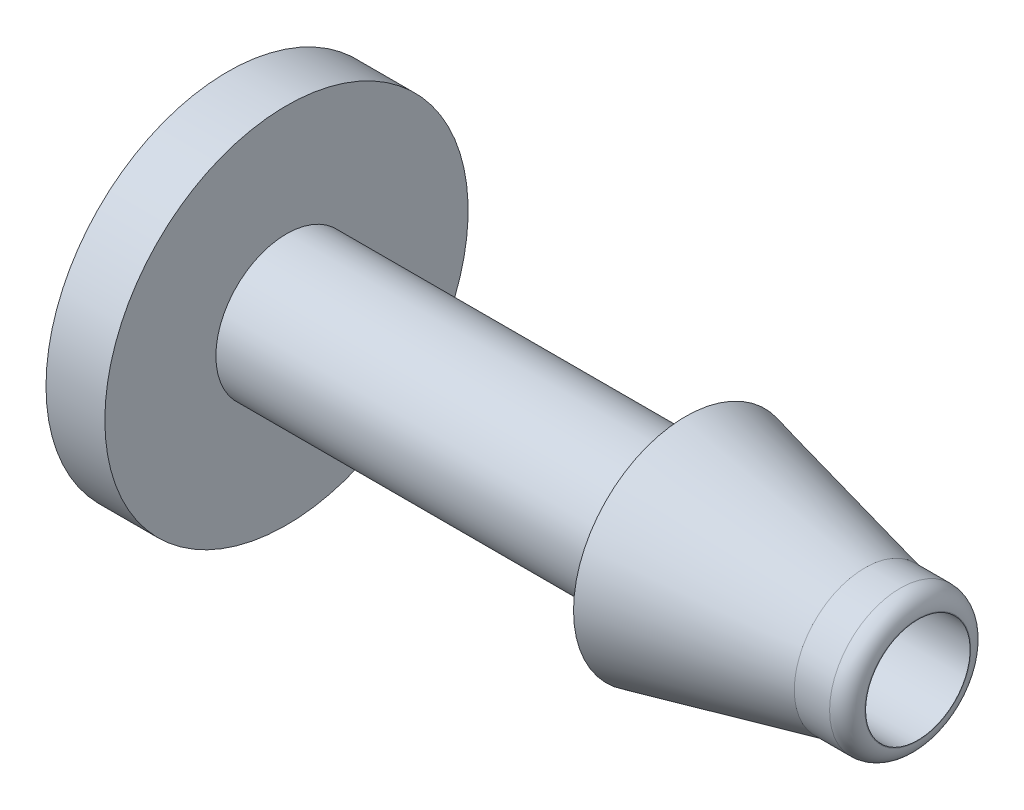
ISO-10303-21;
HEADER;
FILE_DESCRIPTION(('STEP AP214'),'2;1');
FILE_NAME('part.step','',(''),(''),'','','');
FILE_SCHEMA(('AUTOMOTIVE_DESIGN { 1 0 10303 214 1 1 1 1 }'));
ENDSEC;
DATA;
#1=APPLICATION_CONTEXT('core data for automotive mechanical design processes');
#2=APPLICATION_PROTOCOL_DEFINITION('international standard','automotive_design',2000,#1);
#3=PRODUCT_CONTEXT('',#1,'mechanical');
#4=PRODUCT('Part','Part','',(#3));
#5=PRODUCT_RELATED_PRODUCT_CATEGORY('part','',(#4));
#6=PRODUCT_DEFINITION_FORMATION('','',#4);
#7=PRODUCT_DEFINITION_CONTEXT('part definition',#1,'design');
#8=PRODUCT_DEFINITION('design','',#6,#7);
#9=PRODUCT_DEFINITION_SHAPE('','',#8);
#10=(LENGTH_UNIT() NAMED_UNIT(*) SI_UNIT(.MILLI.,.METRE.));
#11=(NAMED_UNIT(*) PLANE_ANGLE_UNIT() SI_UNIT($,.RADIAN.));
#12=(NAMED_UNIT(*) SI_UNIT($,.STERADIAN.) SOLID_ANGLE_UNIT());
#13=UNCERTAINTY_MEASURE_WITH_UNIT(LENGTH_MEASURE(1.E-05),#10,'distance_accuracy_value','');
#14=(GEOMETRIC_REPRESENTATION_CONTEXT(3) GLOBAL_UNCERTAINTY_ASSIGNED_CONTEXT((#13)) GLOBAL_UNIT_ASSIGNED_CONTEXT((#10,
#11,#12)) REPRESENTATION_CONTEXT('',''));
#15=CARTESIAN_POINT('',(0.,0.,0.));
#16=DIRECTION('',(0.,0.,1.));
#17=DIRECTION('',(1.,0.,0.));
#18=AXIS2_PLACEMENT_3D('',#15,#16,#17);
#19=CARTESIAN_POINT('',(0.,0.,0.));
#20=DIRECTION('',(-1.,0.,0.));
#21=DIRECTION('',(0.,0.,1.));
#22=AXIS2_PLACEMENT_3D('',#19,#20,#21);
#23=CYLINDRICAL_SURFACE('',#22,1.778);
#24=CARTESIAN_POINT('',(21.59,0.,0.));
#25=DIRECTION('',(-1.,0.,0.));
#26=DIRECTION('',(0.,0.,1.));
#27=AXIS2_PLACEMENT_3D('',#24,#25,#26);
#28=CIRCLE('',#27,1.778);
#29=CARTESIAN_POINT('',(21.59,0.,1.778));
#30=VERTEX_POINT('',#29);
#31=EDGE_CURVE('E12',#30,#30,#28,.T.);
#32=ORIENTED_EDGE('',*,*,#31,.F.);
#33=EDGE_LOOP('',(#32));
#34=FACE_BOUND('',#33,.T.);
#35=CARTESIAN_POINT('',(-1.873,0.,0.));
#36=DIRECTION('',(-1.,0.,0.));
#37=DIRECTION('',(0.,0.,1.));
#38=AXIS2_PLACEMENT_3D('',#35,#36,#37);
#39=CIRCLE('',#38,1.778);
#40=CARTESIAN_POINT('',(-1.873,0.,1.778));
#41=VERTEX_POINT('',#40);
#42=EDGE_CURVE('E81',#41,#41,#39,.T.);
#43=ORIENTED_EDGE('',*,*,#42,.T.);
#44=EDGE_LOOP('',(#43));
#45=FACE_BOUND('',#44,.T.);
#46=ADVANCED_FACE('F41',(#34,#45),#23,.F.);
#47=CARTESIAN_POINT('',(21.59,1.778,0.));
#48=DIRECTION('',(-1.,0.,0.));
#49=DIRECTION('',(0.,0.,1.));
#50=AXIS2_PLACEMENT_3D('',#47,#48,#49);
#51=PLANE('',#50);
#52=CARTESIAN_POINT('',(21.59,0.,0.));
#53=DIRECTION('',(-1.,0.,0.));
#54=DIRECTION('',(0.,0.,1.));
#55=AXIS2_PLACEMENT_3D('',#52,#53,#54);
#56=CIRCLE('',#55,1.80057777777778);
#57=CARTESIAN_POINT('',(21.59,0.,1.80057777777778));
#58=VERTEX_POINT('',#57);
#59=EDGE_CURVE('E48',#58,#58,#56,.T.);
#60=ORIENTED_EDGE('',*,*,#59,.F.);
#61=EDGE_LOOP('',(#60));
#62=FACE_BOUND('',#61,.T.);
#63=ORIENTED_EDGE('',*,*,#31,.T.);
#64=EDGE_LOOP('',(#63));
#65=FACE_BOUND('',#64,.T.);
#66=ADVANCED_FACE('F107',(#62,#65),#51,.F.);
#67=CARTESIAN_POINT('',(20.9902777777778,0.,0.));
#68=DIRECTION('',(-1.,0.,0.));
#69=DIRECTION('',(0.,0.,1.));
#70=AXIS2_PLACEMENT_3D('',#67,#68,#69);
#71=TOROIDAL_SURFACE('',#70,1.80057777777778,0.599722222222223);
#72=CARTESIAN_POINT('',(20.9902777777778,0.,0.));
#73=DIRECTION('',(-1.,0.,0.));
#74=DIRECTION('',(0.,0.,1.));
#75=AXIS2_PLACEMENT_3D('',#72,#73,#74);
#76=CIRCLE('',#75,2.4003);
#77=CARTESIAN_POINT('',(20.9902777777778,0.,2.4003));
#78=VERTEX_POINT('',#77);
#79=EDGE_CURVE('E53',#78,#78,#76,.T.);
#80=ORIENTED_EDGE('',*,*,#79,.F.);
#81=EDGE_LOOP('',(#80));
#82=FACE_BOUND('',#81,.T.);
#83=ORIENTED_EDGE('',*,*,#59,.T.);
#84=EDGE_LOOP('',(#83));
#85=FACE_BOUND('',#84,.T.);
#86=ADVANCED_FACE('F112',(#82,#85),#71,.T.);
#87=CARTESIAN_POINT('',(0.,0.,0.));
#88=DIRECTION('',(-1.,0.,0.));
#89=DIRECTION('',(0.,0.,1.));
#90=AXIS2_PLACEMENT_3D('',#87,#88,#89);
#91=CYLINDRICAL_SURFACE('',#90,2.4003);
#92=CARTESIAN_POINT('',(19.7908333333333,0.,0.));
#93=DIRECTION('',(-1.,0.,0.));
#94=DIRECTION('',(0.,0.,1.));
#95=AXIS2_PLACEMENT_3D('',#92,#93,#94);
#96=CIRCLE('',#95,2.4003);
#97=CARTESIAN_POINT('',(19.7908333333333,0.,2.4003));
#98=VERTEX_POINT('',#97);
#99=EDGE_CURVE('E58',#98,#98,#96,.T.);
#100=ORIENTED_EDGE('',*,*,#99,.F.);
#101=EDGE_LOOP('',(#100));
#102=FACE_BOUND('',#101,.T.);
#103=ORIENTED_EDGE('',*,*,#79,.T.);
#104=EDGE_LOOP('',(#103));
#105=FACE_BOUND('',#104,.T.);
#106=ADVANCED_FACE('F117',(#102,#105),#91,.T.);
#107=CARTESIAN_POINT('',(19.7908333333333,0.,0.));
#108=DIRECTION('',(-1.,0.,0.));
#109=DIRECTION('',(0.,0.,1.));
#110=AXIS2_PLACEMENT_3D('',#107,#108,#109);
#111=CONICAL_SURFACE('',#110,2.4003,0.227255260619181);
#112=CARTESIAN_POINT('',(13.6948333333333,0.,0.));
#113=DIRECTION('',(-1.,0.,0.));
#114=DIRECTION('',(0.,0.,1.));
#115=AXIS2_PLACEMENT_3D('',#112,#113,#114);
#116=CIRCLE('',#115,3.81);
#117=CARTESIAN_POINT('',(13.6948333333333,0.,3.81));
#118=VERTEX_POINT('',#117);
#119=EDGE_CURVE('E64',#118,#118,#116,.T.);
#120=ORIENTED_EDGE('',*,*,#119,.F.);
#121=EDGE_LOOP('',(#120));
#122=FACE_BOUND('',#121,.T.);
#123=ORIENTED_EDGE('',*,*,#99,.T.);
#124=EDGE_LOOP('',(#123));
#125=FACE_BOUND('',#124,.T.);
#126=ADVANCED_FACE('F123',(#122,#125),#111,.T.);
#127=CARTESIAN_POINT('',(13.6948333333333,3.81,0.));
#128=DIRECTION('',(1.,0.,0.));
#129=DIRECTION('',(0.,0.,-1.));
#130=AXIS2_PLACEMENT_3D('',#127,#128,#129);
#131=PLANE('',#130);
#132=CARTESIAN_POINT('',(13.6948333333333,0.,0.));
#133=DIRECTION('',(-1.,0.,0.));
#134=DIRECTION('',(0.,0.,1.));
#135=AXIS2_PLACEMENT_3D('',#132,#133,#134);
#136=CIRCLE('',#135,2.4003);
#137=CARTESIAN_POINT('',(13.6948333333333,0.,2.4003));
#138=VERTEX_POINT('',#137);
#139=EDGE_CURVE('E68',#138,#138,#136,.T.);
#140=ORIENTED_EDGE('',*,*,#139,.F.);
#141=EDGE_LOOP('',(#140));
#142=FACE_BOUND('',#141,.T.);
#143=ORIENTED_EDGE('',*,*,#119,.T.);
#144=EDGE_LOOP('',(#143));
#145=FACE_BOUND('',#144,.T.);
#146=ADVANCED_FACE('F103',(#142,#145),#131,.F.);
#147=CARTESIAN_POINT('',(0.,0.,0.));
#148=DIRECTION('',(-1.,0.,0.));
#149=DIRECTION('',(0.,0.,1.));
#150=AXIS2_PLACEMENT_3D('',#147,#148,#149);
#151=CYLINDRICAL_SURFACE('',#150,2.4003);
#152=CARTESIAN_POINT('',(0.127000000000002,0.,0.));
#153=DIRECTION('',(1.,0.,0.));
#154=DIRECTION('',(0.,0.,-1.));
#155=AXIS2_PLACEMENT_3D('',#152,#153,#154);
#156=CIRCLE('',#155,2.4003);
#157=CARTESIAN_POINT('',(0.127000000000002,0.,-2.4003));
#158=VERTEX_POINT('',#157);
#159=EDGE_CURVE('E72',#158,#158,#156,.T.);
#160=ORIENTED_EDGE('',*,*,#159,.T.);
#161=EDGE_LOOP('',(#160));
#162=FACE_BOUND('',#161,.T.);
#163=ORIENTED_EDGE('',*,*,#139,.T.);
#164=EDGE_LOOP('',(#163));
#165=FACE_BOUND('',#164,.T.);
#166=ADVANCED_FACE('F93',(#162,#165),#151,.T.);
#167=CARTESIAN_POINT('',(-1.873,0.,0.));
#168=DIRECTION('',(-1.,0.,0.));
#169=DIRECTION('',(0.,0.,1.));
#170=AXIS2_PLACEMENT_3D('',#167,#168,#169);
#171=PLANE('',#170);
#172=CARTESIAN_POINT('',(-1.873,0.,0.));
#173=DIRECTION('',(-1.,0.,0.));
#174=DIRECTION('',(0.,0.,1.));
#175=AXIS2_PLACEMENT_3D('',#172,#173,#174);
#176=CIRCLE('',#175,6.175);
#177=CARTESIAN_POINT('',(-1.873,0.,6.175));
#178=VERTEX_POINT('',#177);
#179=EDGE_CURVE('E76',#178,#178,#176,.T.);
#180=ORIENTED_EDGE('',*,*,#179,.T.);
#181=EDGE_LOOP('',(#180));
#182=FACE_BOUND('',#181,.T.);
#183=ORIENTED_EDGE('',*,*,#42,.F.);
#184=EDGE_LOOP('',(#183));
#185=FACE_BOUND('',#184,.T.);
#186=ADVANCED_FACE('F90',(#182,#185),#171,.T.);
#187=CARTESIAN_POINT('',(0.127000000000002,0.,0.));
#188=DIRECTION('',(-1.,0.,0.));
#189=DIRECTION('',(0.,0.,1.));
#190=AXIS2_PLACEMENT_3D('',#187,#188,#189);
#191=PLANE('',#190);
#192=ORIENTED_EDGE('',*,*,#159,.F.);
#193=EDGE_LOOP('',(#192));
#194=FACE_BOUND('',#193,.T.);
#195=CARTESIAN_POINT('',(0.127000000000002,0.,0.));
#196=DIRECTION('',(-1.,0.,0.));
#197=DIRECTION('',(0.,0.,1.));
#198=AXIS2_PLACEMENT_3D('',#195,#196,#197);
#199=CIRCLE('',#198,6.175);
#200=CARTESIAN_POINT('',(0.127000000000002,0.,6.175));
#201=VERTEX_POINT('',#200);
#202=EDGE_CURVE('E77',#201,#201,#199,.T.);
#203=ORIENTED_EDGE('',*,*,#202,.F.);
#204=EDGE_LOOP('',(#203));
#205=FACE_BOUND('',#204,.T.);
#206=ADVANCED_FACE('F92',(#194,#205),#191,.F.);
#207=CARTESIAN_POINT('',(-1.873,0.,0.));
#208=DIRECTION('',(1.,0.,0.));
#209=DIRECTION('',(0.,0.,-1.));
#210=AXIS2_PLACEMENT_3D('',#207,#208,#209);
#211=CYLINDRICAL_SURFACE('',#210,6.175);
#212=ORIENTED_EDGE('',*,*,#179,.F.);
#213=EDGE_LOOP('',(#212));
#214=FACE_BOUND('',#213,.T.);
#215=ORIENTED_EDGE('',*,*,#202,.T.);
#216=EDGE_LOOP('',(#215));
#217=FACE_BOUND('',#216,.T.);
#218=ADVANCED_FACE('F100',(#214,#217),#211,.T.);
#219=CLOSED_SHELL('',(#46,#66,#86,#106,#126,#146,#166,#186,#206,#218));
#220=MANIFOLD_SOLID_BREP('B2',#219);
#221=ADVANCED_BREP_SHAPE_REPRESENTATION('',(#18,#220),#14);
#222=SHAPE_DEFINITION_REPRESENTATION(#9,#221);
ENDSEC;
END-ISO-10303-21;
